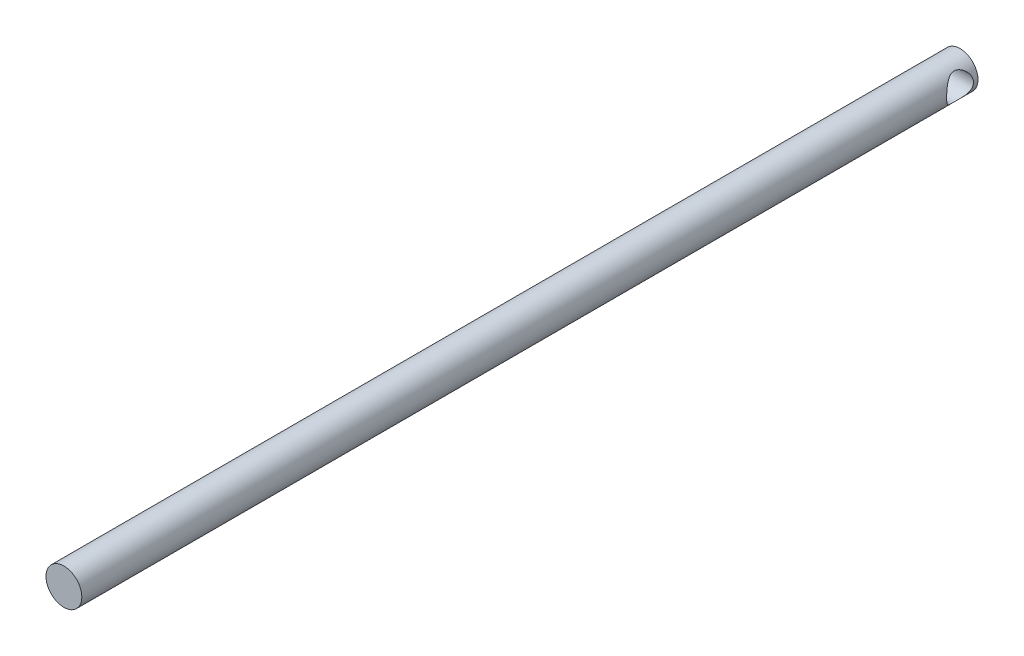
ISO-10303-21;
HEADER;
FILE_DESCRIPTION(('STEP AP214'),'2;1');
FILE_NAME('part.step','',(''),(''),'','','');
FILE_SCHEMA(('AUTOMOTIVE_DESIGN { 1 0 10303 214 1 1 1 1 }'));
ENDSEC;
DATA;
#1=APPLICATION_CONTEXT('core data for automotive mechanical design processes');
#2=APPLICATION_PROTOCOL_DEFINITION('international standard','automotive_design',2000,#1);
#3=PRODUCT_CONTEXT('',#1,'mechanical');
#4=PRODUCT('Part','Part','',(#3));
#5=PRODUCT_RELATED_PRODUCT_CATEGORY('part','',(#4));
#6=PRODUCT_DEFINITION_FORMATION('','',#4);
#7=PRODUCT_DEFINITION_CONTEXT('part definition',#1,'design');
#8=PRODUCT_DEFINITION('design','',#6,#7);
#9=PRODUCT_DEFINITION_SHAPE('','',#8);
#10=(LENGTH_UNIT() NAMED_UNIT(*) SI_UNIT(.MILLI.,.METRE.));
#11=(NAMED_UNIT(*) PLANE_ANGLE_UNIT() SI_UNIT($,.RADIAN.));
#12=(NAMED_UNIT(*) SI_UNIT($,.STERADIAN.) SOLID_ANGLE_UNIT());
#13=UNCERTAINTY_MEASURE_WITH_UNIT(LENGTH_MEASURE(1.E-05),#10,'distance_accuracy_value','');
#14=(GEOMETRIC_REPRESENTATION_CONTEXT(3) GLOBAL_UNCERTAINTY_ASSIGNED_CONTEXT((#13)) GLOBAL_UNIT_ASSIGNED_CONTEXT((#10,
#11,#12)) REPRESENTATION_CONTEXT('',''));
#15=CARTESIAN_POINT('',(0.,0.,0.));
#16=DIRECTION('',(0.,0.,1.));
#17=DIRECTION('',(1.,0.,0.));
#18=AXIS2_PLACEMENT_3D('',#15,#16,#17);
#19=CARTESIAN_POINT('',(0.,0.,500.));
#20=DIRECTION('',(0.,0.,-1.));
#21=DIRECTION('',(-1.,0.,0.));
#22=AXIS2_PLACEMENT_3D('',#19,#20,#21);
#23=CYLINDRICAL_SURFACE('',#22,10.);
#24=CARTESIAN_POINT('',(-10.,0.,2.5));
#25=CARTESIAN_POINT('',(-9.99999825220043,0.183148360631224,2.50000181106261));
#26=CARTESIAN_POINT('',(-9.99495621731441,0.366342585140464,2.50672095644631));
#27=CARTESIAN_POINT('',(-9.97490143097507,0.731284647804646,2.5334924645278));
#28=CARTESIAN_POINT('',(-9.95988271339075,0.913031554599345,2.55355280536876));
#29=CARTESIAN_POINT('',(-9.9201917868147,1.27389276294165,2.60672475330212));
#30=CARTESIAN_POINT('',(-9.89550118322144,1.45300136929127,2.63986123030484));
#31=CARTESIAN_POINT('',(-9.83702172640045,1.8069893726824,2.71867503216433));
#32=CARTESIAN_POINT('',(-9.80322881221236,1.98186684397495,2.76435795474781));
#33=CARTESIAN_POINT('',(-9.72752378128582,2.32506995293138,2.86726367830834));
#34=CARTESIAN_POINT('',(-9.6856665671512,2.49343113760904,2.92440854751618));
#35=CARTESIAN_POINT('',(-9.59451489400363,2.82395570771372,3.04970833708236));
#36=CARTESIAN_POINT('',(-9.5452174929203,2.98611660943024,3.11786761362111));
#37=CARTESIAN_POINT('',(-9.38756843011347,3.46192400316672,3.33764786702261));
#38=CARTESIAN_POINT('',(-9.26935773011459,3.76534217699647,3.50470784255644));
#39=CARTESIAN_POINT('',(-9.00247083181558,4.36738031046613,3.89132929284911));
#40=CARTESIAN_POINT('',(-8.85198712189838,4.66295396944976,4.11431999491101));
#41=CARTESIAN_POINT('',(-8.53832916588274,5.21514803427101,4.59749586451611));
#42=CARTESIAN_POINT('',(-8.37513550772825,5.47170701559805,4.85773845612116));
#43=CARTESIAN_POINT('',(-8.11230548493661,5.84983236323795,5.30133924823523));
#44=CARTESIAN_POINT('',(-8.01322272061777,5.98448699541009,5.4740761780575));
#45=CARTESIAN_POINT('',(-7.81692237304354,6.23870842573754,5.83147192975619));
#46=CARTESIAN_POINT('',(-7.71970535968098,6.35827067422418,6.01613432137959));
#47=CARTESIAN_POINT('',(-7.53024443396407,6.58155279088788,6.39697113731399));
#48=CARTESIAN_POINT('',(-7.43799561146134,6.68528849377295,6.59313377971528));
#49=CARTESIAN_POINT('',(-7.26194992595442,6.87611265864527,6.99684291791223));
#50=CARTESIAN_POINT('',(-7.17814826410121,6.96321059804277,7.20438284559713));
#51=CARTESIAN_POINT('',(-6.99885956719935,7.14400878104046,7.69745354761176));
#52=CARTESIAN_POINT('',(-6.9078729915952,7.23130376139035,7.98712901800543));
#53=CARTESIAN_POINT('',(-6.79582705692467,7.33616747091051,8.43346972395359));
#54=CARTESIAN_POINT('',(-6.7625626495277,7.36676563602348,8.58413268665275));
#55=CARTESIAN_POINT('',(-6.70541097180997,7.41882486802788,8.88875166846226));
#56=CARTESIAN_POINT('',(-6.68151886959137,7.44029064361234,9.04270594744627));
#57=CARTESIAN_POINT('',(-6.64399487351841,7.4738195774795,9.35438467266927));
#58=CARTESIAN_POINT('',(-6.63046224230684,7.48579180837431,9.51213101210689));
#59=CARTESIAN_POINT('',(-6.61471013710175,7.49971481213819,9.82863357712388));
#60=CARTESIAN_POINT('',(-6.61249035269244,7.50166585998078,9.98738977487384));
#61=CARTESIAN_POINT('',(-6.61948621008001,7.49549374588534,10.3045070458082));
#62=CARTESIAN_POINT('',(-6.62870559451458,7.48736728681514,10.4628679726797));
#63=CARTESIAN_POINT('',(-6.65809333447629,7.46124382754021,10.7777067944034));
#64=CARTESIAN_POINT('',(-6.6782618015552,7.44324672677111,10.934184670054));
#65=CARTESIAN_POINT('',(-6.74840995476556,7.37988631197293,11.3657496870096));
#66=CARTESIAN_POINT('',(-6.80936438102533,7.32413018954154,11.6376055670218));
#67=CARTESIAN_POINT('',(-6.95570310792852,7.18527767988214,12.1672707552838));
#68=CARTESIAN_POINT('',(-7.04111087930064,7.10215501424415,12.4250662838031));
#69=CARTESIAN_POINT('',(-7.21099153900677,6.92917382263755,12.8781694832614));
#70=CARTESIAN_POINT('',(-7.29266351327928,6.84346833605325,13.0761594238641));
#71=CARTESIAN_POINT('',(-7.46342165901279,6.65682611972849,13.46158098312));
#72=CARTESIAN_POINT('',(-7.55251162228971,6.55588157861579,13.6490071188232));
#73=CARTESIAN_POINT('',(-7.73517823120313,6.33933222593356,14.0134638359849));
#74=CARTESIAN_POINT('',(-7.82876380678446,6.22369741624747,14.1904720297294));
#75=CARTESIAN_POINT('',(-8.01761553681547,5.97844426893635,14.5335028841527));
#76=CARTESIAN_POINT('',(-8.11288142581883,5.84882812374303,14.6995272606499));
#77=CARTESIAN_POINT('',(-8.30521453319946,5.57247402890015,15.024354951916));
#78=CARTESIAN_POINT('',(-8.40226649936021,5.42538639972571,15.1828700952384));
#79=CARTESIAN_POINT('',(-8.5935031315706,5.11709028531976,15.4874712931344));
#80=CARTESIAN_POINT('',(-8.68768750660852,4.95588037331081,15.6335560889212));
#81=CARTESIAN_POINT('',(-8.87089324795422,4.61993509999966,15.9121685815808));
#82=CARTESIAN_POINT('',(-8.9599230830712,4.44522309293499,16.0447188059507));
#83=CARTESIAN_POINT('',(-9.13090472642982,4.08249343487889,16.2953804981527));
#84=CARTESIAN_POINT('',(-9.21285834099645,3.89447920193417,16.4134956539972));
#85=CARTESIAN_POINT('',(-9.35211813533672,3.54483535127364,16.6118106225478));
#86=CARTESIAN_POINT('',(-9.41107137526017,3.38547499880139,16.6948639787926));
#87=CARTESIAN_POINT('',(-9.52211460031246,3.05924910859919,16.8500808784182));
#88=CARTESIAN_POINT('',(-9.57420599638373,2.89238512327235,16.9222466609628));
#89=CARTESIAN_POINT('',(-9.67052015896568,2.55192522953366,17.0548590763305));
#90=CARTESIAN_POINT('',(-9.71474587063951,2.37833187059297,17.1153100962974));
#91=CARTESIAN_POINT('',(-9.7944303324846,2.02530797337889,17.2237259983825));
#92=CARTESIAN_POINT('',(-9.82988897006302,1.84587736017292,17.2716907201434));
#93=CARTESIAN_POINT('',(-9.89142668215868,1.48124003999791,17.3546653228274));
#94=CARTESIAN_POINT('',(-9.91744578882848,1.29600425567115,17.3895924169133));
#95=CARTESIAN_POINT('',(-9.95915423278582,0.922276966538737,17.4454751063309));
#96=CARTESIAN_POINT('',(-9.97484354492046,0.733785453806582,17.4664306676423));
#97=CARTESIAN_POINT('',(-9.99548555303477,0.355230498112983,17.4939852447411));
#98=CARTESIAN_POINT('',(-10.0004418293711,0.165167600582668,17.5005890480314));
#99=CARTESIAN_POINT('',(-9.99949640206274,-0.214874139571318,17.4993285937768));
#100=CARTESIAN_POINT('',(-9.99359555401241,-0.404852987638413,17.4914654762959));
#101=CARTESIAN_POINT('',(-9.97223305994797,-0.763928127056921,17.4629423697379));
#102=CARTESIAN_POINT('',(-9.95779618888371,-0.933197305435485,17.4436536580073));
#103=CARTESIAN_POINT('',(-9.92057133553495,-1.26918880187071,17.393781950484));
#104=CARTESIAN_POINT('',(-9.89778056893783,-1.43591025146061,17.36319518908));
#105=CARTESIAN_POINT('',(-9.84430767733922,-1.76564432096826,17.2911573494213));
#106=CARTESIAN_POINT('',(-9.81362747999547,-1.92865783628605,17.2497089249952));
#107=CARTESIAN_POINT('',(-9.74493618777163,-2.25016822648629,17.1564499227148));
#108=CARTESIAN_POINT('',(-9.70692222377835,-2.40866330572276,17.1046352891018));
#109=CARTESIAN_POINT('',(-9.62279034107677,-2.72575422161847,16.9892566436357));
#110=CARTESIAN_POINT('',(-9.57643622072002,-2.88416117889076,16.9253461741077));
#111=CARTESIAN_POINT('',(-9.47738924248976,-3.19463271777294,16.7877229490928));
#112=CARTESIAN_POINT('',(-9.42469423001768,-3.34669511976835,16.714006860811));
#113=CARTESIAN_POINT('',(-9.25839398463924,-3.79243668836605,16.4792069241768));
#114=CARTESIAN_POINT('',(-9.13650809547068,-4.0759094224292,16.3043830298445));
#115=CARTESIAN_POINT('',(-8.85592689861201,-4.65763303463208,15.8910388757337));
#116=CARTESIAN_POINT('',(-8.69448369509785,-4.95044606090116,15.6467569844664));
#117=CARTESIAN_POINT('',(-8.44516881462102,-5.35767107336566,15.2517852965719));
#118=CARTESIAN_POINT('',(-8.36074234741944,-5.48824918209259,15.1151472141624));
#119=CARTESIAN_POINT('',(-8.19100904652956,-5.73848345968049,14.8327407122706));
#120=CARTESIAN_POINT('',(-8.10570242630511,-5.85814221058998,14.6869744651008));
#121=CARTESIAN_POINT('',(-7.91961196391863,-6.10806144849819,14.3579836003852));
#122=CARTESIAN_POINT('',(-7.81897317293294,-6.23600392340882,14.1729105765989));
#123=CARTESIAN_POINT('',(-7.62168627596285,-6.47564568677308,13.7903779523481));
#124=CARTESIAN_POINT('',(-7.52503964549599,-6.58733900727102,13.5929138388307));
#125=CARTESIAN_POINT('',(-7.33958950470876,-6.79334858159907,13.1862601442869));
#126=CARTESIAN_POINT('',(-7.2507678217486,-6.88770568215121,12.9770996801148));
#127=CARTESIAN_POINT('',(-7.08503810393456,-7.05807032553021,12.546968719068));
#128=CARTESIAN_POINT('',(-7.00812021113291,-7.13409308112476,12.3260082004461));
#129=CARTESIAN_POINT('',(-6.89776536900087,-7.24045739920368,11.9612634200972));
#130=CARTESIAN_POINT('',(-6.85905105065739,-7.27706722475707,11.820878649422));
#131=CARTESIAN_POINT('',(-6.78909215619301,-7.34237828490353,11.5364734323071));
#132=CARTESIAN_POINT('',(-6.75784495867727,-7.37108229544015,11.3924542814349));
#133=CARTESIAN_POINT('',(-6.70397772845789,-7.42010866141178,11.1016728535583));
#134=CARTESIAN_POINT('',(-6.68134175721603,-7.4404465075322,10.9549161770611));
#135=CARTESIAN_POINT('',(-6.64553659947693,-7.47244433482206,10.6592977877309));
#136=CARTESIAN_POINT('',(-6.63236743689916,-7.48410429406539,10.5104360695801));
#137=CARTESIAN_POINT('',(-6.61604392687071,-7.49853887636308,10.2109543865269));
#138=CARTESIAN_POINT('',(-6.61294157310429,-7.5012673702604,10.060329313336));
#139=CARTESIAN_POINT('',(-6.61704410383112,-7.49764855771467,9.75933492899877));
#140=CARTESIAN_POINT('',(-6.6242487717127,-7.49130144200399,9.60896561254406));
#141=CARTESIAN_POINT('',(-6.64864042221955,-7.46966150960367,9.30955966115998));
#142=CARTESIAN_POINT('',(-6.66583653866429,-7.45436050750457,9.1605243725003));
#143=CARTESIAN_POINT('',(-6.70947271822503,-7.41510828933917,8.86491296274473));
#144=CARTESIAN_POINT('',(-6.73591768435148,-7.39115248495673,8.71833818929699));
#145=CARTESIAN_POINT('',(-6.80366991769713,-7.32888993758964,8.39698143694981));
#146=CARTESIAN_POINT('',(-6.84695911424574,-7.28859466709028,8.22300243854851));
#147=CARTESIAN_POINT('',(-6.94360749633832,-7.19657956576836,7.8808805847487));
#148=CARTESIAN_POINT('',(-6.99697427787176,-7.14485111212704,7.71274224567655));
#149=CARTESIAN_POINT('',(-7.11173285585202,-7.03063417120002,7.38260515556822));
#150=CARTESIAN_POINT('',(-7.17314049085418,-6.96812436806886,7.22061935799918));
#151=CARTESIAN_POINT('',(-7.30189696957417,-6.83308175773697,6.90343735825427));
#152=CARTESIAN_POINT('',(-7.36924400073342,-6.76055200457875,6.74823910616528));
#153=CARTESIAN_POINT('',(-7.53227527340475,-6.57908862155701,6.39191440763987));
#154=CARTESIAN_POINT('',(-7.62967949604614,-6.46625899136202,6.19355104030994));
#155=CARTESIAN_POINT('',(-7.82848797542238,-6.22409397674892,5.80926560822968));
#156=CARTESIAN_POINT('',(-7.92989347166993,-6.09475344941421,5.62334744761327));
#157=CARTESIAN_POINT('',(-8.13368678615596,-5.82000166017292,5.26410018248664));
#158=CARTESIAN_POINT('',(-8.23607528693576,-5.67457836362909,5.09078066839321));
#159=CARTESIAN_POINT('',(-8.43902615179917,-5.36811116429771,4.75742106763493));
#160=CARTESIAN_POINT('',(-8.53958873605844,-5.20706915992245,4.5973793714633));
#161=CARTESIAN_POINT('',(-8.73722404742755,-4.86823444610667,4.29009342782366));
#162=CARTESIAN_POINT('',(-8.83426032912377,-4.69031229919782,4.1429680758643));
#163=CARTESIAN_POINT('',(-9.02148209885813,-4.31926384766125,3.86422000820311));
#164=CARTESIAN_POINT('',(-9.11166669061666,-4.12613556060168,3.73259931945357));
#165=CARTESIAN_POINT('',(-9.28256253574139,-3.72576429558786,3.48664683473564));
#166=CARTESIAN_POINT('',(-9.36329167565035,-3.51854917893225,3.37228227378446));
#167=CARTESIAN_POINT('',(-9.51304471510835,-3.09083237545736,3.16235194822691));
#168=CARTESIAN_POINT('',(-9.5820746530538,-2.87033762289901,3.06677648176524));
#169=CARTESIAN_POINT('',(-9.68796526126722,-2.48412405824608,2.9212735772535));
#170=CARTESIAN_POINT('',(-9.72832482945904,-2.32129005811085,2.86617700851184));
#171=CARTESIAN_POINT('',(-9.80132549603498,-1.9906420118458,2.76694296017012));
#172=CARTESIAN_POINT('',(-9.83396846856479,-1.82282918610053,2.72280281942897));
#173=CARTESIAN_POINT('',(-9.89082818213226,-1.48358839494539,2.64614790452321));
#174=CARTESIAN_POINT('',(-9.91506439962452,-1.31216977477246,2.61360625452351));
#175=CARTESIAN_POINT('',(-9.95469855719796,-0.966540401338081,2.56048804100351));
#176=CARTESIAN_POINT('',(-9.9701010169854,-0.792331122875267,2.53990535872308));
#177=CARTESIAN_POINT('',(-9.98726751877774,-0.514835906933092,2.51698319841702));
#178=CARTESIAN_POINT('',(-9.99203792739739,-0.412044960462382,2.51061884813289));
#179=CARTESIAN_POINT('',(-9.9984049153868,-0.206174215981064,2.50212639822716));
#180=CARTESIAN_POINT('',(-10.0000009838379,-0.103094374145229,2.49999898055125));
#181=CARTESIAN_POINT('',(-10.,0.,2.5));
#182=B_SPLINE_CURVE_WITH_KNOTS('',3,(#24,#25,#26,#27,#28,#29,#30,#31,#32,#33,#34,#35,#36,#37,
#38,#39,#40,#41,#42,#43,#44,#45,#46,#47,#48,#49,#50,#51,#52,#53,#54,#55,#56,#57,#58,#59,#60,#61,
#62,#63,#64,#65,#66,#67,#68,#69,#70,#71,#72,#73,#74,#75,#76,#77,#78,#79,#80,#81,#82,#83,#84,#85,
#86,#87,#88,#89,#90,#91,#92,#93,#94,#95,#96,#97,#98,#99,#100,#101,#102,#103,#104,#105,#106,#107,
#108,#109,#110,#111,#112,#113,#114,#115,#116,#117,#118,#119,#120,#121,#122,#123,#124,#125,#126,
#127,#128,#129,#130,#131,#132,#133,#134,#135,#136,#137,#138,#139,#140,#141,#142,#143,#144,#145,
#146,#147,#148,#149,#150,#151,#152,#153,#154,#155,#156,#157,#158,#159,#160,#161,#162,#163,#164,
#165,#166,#167,#168,#169,#170,#171,#172,#173,#174,#175,#176,#177,#178,#179,#180,#181),
.UNSPECIFIED.,.T.,.F.,(4,2,2,2,2,2,2,2,2,2,2,2,2,2,2,2,2,2,2,2,2,2,2,2,2,2,2,2,2,2,2,2,2,2,2,2,
2,2,2,2,2,2,2,2,2,2,2,2,2,2,2,2,2,2,2,2,2,2,2,2,2,2,2,2,2,2,2,2,2,2,2,2,2,2,2,2,2,2,4),(0.,
0.549333810396349,1.09899642261334,1.64970953325451,2.20066875053375,2.74800168216963,
3.29555161528971,4.38923194166926,5.58419151329428,6.78101336768092,7.50152042078937,
8.22224415798694,8.94224200290019,9.6618284825884,10.6057257062582,11.0771415311411,
11.5483139968762,12.0239465220089,12.4995659960823,12.9753411231469,13.4511210976087,
14.3000658907337,15.1498282626302,15.8409837223713,16.5324946713612,17.2254411215001,
17.9182790673241,18.6286106705283,19.3390141216436,20.0482151836289,20.7572346715093,
21.3240789510858,21.8908064927599,22.4573213847599,23.0238435519584,23.5939042031105,
24.163966242347,24.733838089351,25.3036650295946,25.8159956353881,26.3284971539712,
26.8408735696905,27.3534508450853,27.8838865184232,28.4145029424248,29.4749536671179,
30.7125000722884,31.3331067040452,31.9535662015578,32.6921380168984,33.4309804122227,
34.168059012369,34.9045239072425,35.3546199278826,35.804557705681,36.2536585931601,
36.7027606153631,37.1541785263257,37.6055869504596,38.0574086864992,38.5094703067444,
39.0599080061886,39.610762266734,40.1627183763172,40.7145066214401,41.457880510944,
42.2014865187519,42.9456527762346,43.6897286953816,44.440059867972,45.1904890240893,
45.9394748739468,46.6880729590086,47.2172824489513,47.7463632763237,48.2742100312628,
48.801786477061,49.1109572068324,49.4201776944439),.UNSPECIFIED.);
#183=CARTESIAN_POINT('',(-10.,0.,2.5));
#184=VERTEX_POINT('',#183);
#185=EDGE_CURVE('E10',#184,#184,#182,.T.);
#186=ORIENTED_EDGE('',*,*,#185,.T.);
#187=EDGE_LOOP('',(#186));
#188=FACE_BOUND('',#187,.T.);
#189=CARTESIAN_POINT('',(10.,0.,2.5));
#190=CARTESIAN_POINT('',(9.99999825220043,-0.183148360631224,2.50000181106261));
#191=CARTESIAN_POINT('',(9.99495621731441,-0.366342585140464,2.50672095644631));
#192=CARTESIAN_POINT('',(9.97490143097507,-0.731284647804646,2.5334924645278));
#193=CARTESIAN_POINT('',(9.95988271339075,-0.913031554599345,2.55355280536876));
#194=CARTESIAN_POINT('',(9.9201917868147,-1.27389276294165,2.60672475330212));
#195=CARTESIAN_POINT('',(9.89550118322144,-1.45300136929127,2.63986123030484));
#196=CARTESIAN_POINT('',(9.83702172640045,-1.8069893726824,2.71867503216433));
#197=CARTESIAN_POINT('',(9.80322881221236,-1.98186684397495,2.76435795474781));
#198=CARTESIAN_POINT('',(9.72752378128582,-2.32506995293138,2.86726367830834));
#199=CARTESIAN_POINT('',(9.6856665671512,-2.49343113760904,2.92440854751618));
#200=CARTESIAN_POINT('',(9.59451489400363,-2.82395570771372,3.04970833708236));
#201=CARTESIAN_POINT('',(9.5452174929203,-2.98611660943024,3.11786761362111));
#202=CARTESIAN_POINT('',(9.38756843011347,-3.46192400316672,3.33764786702261));
#203=CARTESIAN_POINT('',(9.26935773011459,-3.76534217699647,3.50470784255644));
#204=CARTESIAN_POINT('',(9.00247083181558,-4.36738031046613,3.89132929284911));
#205=CARTESIAN_POINT('',(8.85198712189838,-4.66295396944976,4.11431999491101));
#206=CARTESIAN_POINT('',(8.53832916588274,-5.21514803427101,4.59749586451611));
#207=CARTESIAN_POINT('',(8.37513550772825,-5.47170701559805,4.85773845612116));
#208=CARTESIAN_POINT('',(8.11230548493661,-5.84983236323795,5.30133924823523));
#209=CARTESIAN_POINT('',(8.01322272061777,-5.98448699541009,5.4740761780575));
#210=CARTESIAN_POINT('',(7.81692237304354,-6.23870842573754,5.83147192975619));
#211=CARTESIAN_POINT('',(7.71970535968098,-6.35827067422418,6.01613432137959));
#212=CARTESIAN_POINT('',(7.53024443396407,-6.58155279088788,6.39697113731399));
#213=CARTESIAN_POINT('',(7.43799561146134,-6.68528849377295,6.59313377971528));
#214=CARTESIAN_POINT('',(7.26194992595442,-6.87611265864527,6.99684291791223));
#215=CARTESIAN_POINT('',(7.17814826410121,-6.96321059804277,7.20438284559713));
#216=CARTESIAN_POINT('',(6.99885956719935,-7.14400878104046,7.69745354761176));
#217=CARTESIAN_POINT('',(6.9078729915952,-7.23130376139035,7.98712901800543));
#218=CARTESIAN_POINT('',(6.79582705692467,-7.33616747091051,8.43346972395359));
#219=CARTESIAN_POINT('',(6.7625626495277,-7.36676563602348,8.58413268665275));
#220=CARTESIAN_POINT('',(6.70541097180997,-7.41882486802788,8.88875166846226));
#221=CARTESIAN_POINT('',(6.68151886959137,-7.44029064361234,9.04270594744627));
#222=CARTESIAN_POINT('',(6.64399487351841,-7.4738195774795,9.35438467266927));
#223=CARTESIAN_POINT('',(6.63046224230684,-7.48579180837431,9.51213101210689));
#224=CARTESIAN_POINT('',(6.61471013710175,-7.49971481213819,9.82863357712388));
#225=CARTESIAN_POINT('',(6.61249035269244,-7.50166585998078,9.98738977487384));
#226=CARTESIAN_POINT('',(6.61948621008001,-7.49549374588534,10.3045070458082));
#227=CARTESIAN_POINT('',(6.62870559451458,-7.48736728681514,10.4628679726797));
#228=CARTESIAN_POINT('',(6.65809333447629,-7.46124382754021,10.7777067944034));
#229=CARTESIAN_POINT('',(6.6782618015552,-7.44324672677111,10.934184670054));
#230=CARTESIAN_POINT('',(6.74840995476556,-7.37988631197293,11.3657496870096));
#231=CARTESIAN_POINT('',(6.80936438102533,-7.32413018954154,11.6376055670218));
#232=CARTESIAN_POINT('',(6.95570310792852,-7.18527767988214,12.1672707552838));
#233=CARTESIAN_POINT('',(7.04111087930064,-7.10215501424415,12.4250662838031));
#234=CARTESIAN_POINT('',(7.21099153900677,-6.92917382263755,12.8781694832614));
#235=CARTESIAN_POINT('',(7.29266351327928,-6.84346833605325,13.0761594238641));
#236=CARTESIAN_POINT('',(7.46342165901279,-6.65682611972849,13.46158098312));
#237=CARTESIAN_POINT('',(7.55251162228971,-6.55588157861579,13.6490071188232));
#238=CARTESIAN_POINT('',(7.73517823120313,-6.33933222593356,14.0134638359849));
#239=CARTESIAN_POINT('',(7.82876380678446,-6.22369741624747,14.1904720297294));
#240=CARTESIAN_POINT('',(8.01761553681547,-5.97844426893635,14.5335028841527));
#241=CARTESIAN_POINT('',(8.11288142581883,-5.84882812374303,14.6995272606499));
#242=CARTESIAN_POINT('',(8.30521453319946,-5.57247402890015,15.024354951916));
#243=CARTESIAN_POINT('',(8.40226649936021,-5.42538639972571,15.1828700952384));
#244=CARTESIAN_POINT('',(8.5935031315706,-5.11709028531976,15.4874712931344));
#245=CARTESIAN_POINT('',(8.68768750660852,-4.95588037331081,15.6335560889212));
#246=CARTESIAN_POINT('',(8.87089324795422,-4.61993509999966,15.9121685815808));
#247=CARTESIAN_POINT('',(8.9599230830712,-4.44522309293499,16.0447188059507));
#248=CARTESIAN_POINT('',(9.13090472642982,-4.08249343487889,16.2953804981527));
#249=CARTESIAN_POINT('',(9.21285834099645,-3.89447920193417,16.4134956539972));
#250=CARTESIAN_POINT('',(9.35211813533672,-3.54483535127364,16.6118106225478));
#251=CARTESIAN_POINT('',(9.41107137526017,-3.38547499880139,16.6948639787926));
#252=CARTESIAN_POINT('',(9.52211460031246,-3.05924910859919,16.8500808784182));
#253=CARTESIAN_POINT('',(9.57420599638373,-2.89238512327235,16.9222466609628));
#254=CARTESIAN_POINT('',(9.67052015896568,-2.55192522953366,17.0548590763305));
#255=CARTESIAN_POINT('',(9.71474587063951,-2.37833187059297,17.1153100962974));
#256=CARTESIAN_POINT('',(9.7944303324846,-2.02530797337889,17.2237259983825));
#257=CARTESIAN_POINT('',(9.82988897006302,-1.84587736017292,17.2716907201434));
#258=CARTESIAN_POINT('',(9.89142668215868,-1.48124003999791,17.3546653228274));
#259=CARTESIAN_POINT('',(9.91744578882848,-1.29600425567115,17.3895924169133));
#260=CARTESIAN_POINT('',(9.95915423278582,-0.922276966538737,17.4454751063309));
#261=CARTESIAN_POINT('',(9.97484354492046,-0.733785453806582,17.4664306676423));
#262=CARTESIAN_POINT('',(9.99548555303477,-0.355230498112983,17.4939852447411));
#263=CARTESIAN_POINT('',(10.0004418293711,-0.165167600582668,17.5005890480314));
#264=CARTESIAN_POINT('',(9.99949640206274,0.214874139571318,17.4993285937768));
#265=CARTESIAN_POINT('',(9.99359555401241,0.404852987638413,17.4914654762959));
#266=CARTESIAN_POINT('',(9.97223305994797,0.763928127056921,17.4629423697379));
#267=CARTESIAN_POINT('',(9.95779618888371,0.933197305435485,17.4436536580073));
#268=CARTESIAN_POINT('',(9.92057133553495,1.26918880187071,17.393781950484));
#269=CARTESIAN_POINT('',(9.89778056893783,1.43591025146061,17.36319518908));
#270=CARTESIAN_POINT('',(9.84430767733922,1.76564432096826,17.2911573494213));
#271=CARTESIAN_POINT('',(9.81362747999547,1.92865783628605,17.2497089249952));
#272=CARTESIAN_POINT('',(9.74493618777163,2.25016822648629,17.1564499227148));
#273=CARTESIAN_POINT('',(9.70692222377835,2.40866330572276,17.1046352891018));
#274=CARTESIAN_POINT('',(9.62279034107677,2.72575422161847,16.9892566436357));
#275=CARTESIAN_POINT('',(9.57643622072002,2.88416117889076,16.9253461741077));
#276=CARTESIAN_POINT('',(9.47738924248976,3.19463271777294,16.7877229490928));
#277=CARTESIAN_POINT('',(9.42469423001768,3.34669511976835,16.714006860811));
#278=CARTESIAN_POINT('',(9.25839398463924,3.79243668836605,16.4792069241768));
#279=CARTESIAN_POINT('',(9.13650809547068,4.0759094224292,16.3043830298445));
#280=CARTESIAN_POINT('',(8.85592689861201,4.65763303463208,15.8910388757337));
#281=CARTESIAN_POINT('',(8.69448369509785,4.95044606090116,15.6467569844664));
#282=CARTESIAN_POINT('',(8.44516881462102,5.35767107336566,15.2517852965719));
#283=CARTESIAN_POINT('',(8.36074234741944,5.48824918209259,15.1151472141624));
#284=CARTESIAN_POINT('',(8.19100904652956,5.73848345968049,14.8327407122706));
#285=CARTESIAN_POINT('',(8.10570242630511,5.85814221058998,14.6869744651008));
#286=CARTESIAN_POINT('',(7.91961196391863,6.10806144849819,14.3579836003852));
#287=CARTESIAN_POINT('',(7.81897317293294,6.23600392340882,14.1729105765989));
#288=CARTESIAN_POINT('',(7.62168627596285,6.47564568677308,13.7903779523481));
#289=CARTESIAN_POINT('',(7.52503964549599,6.58733900727102,13.5929138388307));
#290=CARTESIAN_POINT('',(7.33958950470876,6.79334858159907,13.1862601442869));
#291=CARTESIAN_POINT('',(7.2507678217486,6.88770568215121,12.9770996801148));
#292=CARTESIAN_POINT('',(7.08503810393456,7.05807032553021,12.546968719068));
#293=CARTESIAN_POINT('',(7.00812021113291,7.13409308112476,12.3260082004461));
#294=CARTESIAN_POINT('',(6.89776536900087,7.24045739920368,11.9612634200972));
#295=CARTESIAN_POINT('',(6.85905105065739,7.27706722475707,11.820878649422));
#296=CARTESIAN_POINT('',(6.78909215619301,7.34237828490353,11.5364734323071));
#297=CARTESIAN_POINT('',(6.75784495867727,7.37108229544015,11.3924542814349));
#298=CARTESIAN_POINT('',(6.70397772845789,7.42010866141178,11.1016728535583));
#299=CARTESIAN_POINT('',(6.68134175721603,7.4404465075322,10.9549161770611));
#300=CARTESIAN_POINT('',(6.64553659947693,7.47244433482206,10.6592977877309));
#301=CARTESIAN_POINT('',(6.63236743689916,7.48410429406539,10.5104360695801));
#302=CARTESIAN_POINT('',(6.61604392687071,7.49853887636308,10.2109543865269));
#303=CARTESIAN_POINT('',(6.61294157310429,7.5012673702604,10.060329313336));
#304=CARTESIAN_POINT('',(6.61704410383112,7.49764855771467,9.75933492899877));
#305=CARTESIAN_POINT('',(6.6242487717127,7.49130144200399,9.60896561254406));
#306=CARTESIAN_POINT('',(6.64864042221955,7.46966150960367,9.30955966115998));
#307=CARTESIAN_POINT('',(6.66583653866429,7.45436050750457,9.1605243725003));
#308=CARTESIAN_POINT('',(6.70947271822503,7.41510828933917,8.86491296274473));
#309=CARTESIAN_POINT('',(6.73591768435148,7.39115248495673,8.71833818929699));
#310=CARTESIAN_POINT('',(6.80366991769713,7.32888993758964,8.39698143694981));
#311=CARTESIAN_POINT('',(6.84695911424574,7.28859466709028,8.22300243854851));
#312=CARTESIAN_POINT('',(6.94360749633832,7.19657956576836,7.8808805847487));
#313=CARTESIAN_POINT('',(6.99697427787176,7.14485111212704,7.71274224567655));
#314=CARTESIAN_POINT('',(7.11173285585202,7.03063417120002,7.38260515556822));
#315=CARTESIAN_POINT('',(7.17314049085418,6.96812436806886,7.22061935799918));
#316=CARTESIAN_POINT('',(7.30189696957417,6.83308175773697,6.90343735825427));
#317=CARTESIAN_POINT('',(7.36924400073342,6.76055200457875,6.74823910616528));
#318=CARTESIAN_POINT('',(7.53227527340475,6.57908862155701,6.39191440763987));
#319=CARTESIAN_POINT('',(7.62967949604614,6.46625899136202,6.19355104030994));
#320=CARTESIAN_POINT('',(7.82848797542238,6.22409397674892,5.80926560822968));
#321=CARTESIAN_POINT('',(7.92989347166993,6.09475344941421,5.62334744761327));
#322=CARTESIAN_POINT('',(8.13368678615596,5.82000166017292,5.26410018248664));
#323=CARTESIAN_POINT('',(8.23607528693576,5.67457836362909,5.09078066839321));
#324=CARTESIAN_POINT('',(8.43902615179917,5.36811116429771,4.75742106763493));
#325=CARTESIAN_POINT('',(8.53958873605844,5.20706915992245,4.5973793714633));
#326=CARTESIAN_POINT('',(8.73722404742755,4.86823444610667,4.29009342782366));
#327=CARTESIAN_POINT('',(8.83426032912377,4.69031229919782,4.1429680758643));
#328=CARTESIAN_POINT('',(9.02148209885813,4.31926384766125,3.86422000820311));
#329=CARTESIAN_POINT('',(9.11166669061666,4.12613556060168,3.73259931945357));
#330=CARTESIAN_POINT('',(9.28256253574139,3.72576429558786,3.48664683473564));
#331=CARTESIAN_POINT('',(9.36329167565035,3.51854917893225,3.37228227378446));
#332=CARTESIAN_POINT('',(9.51304471510835,3.09083237545736,3.16235194822691));
#333=CARTESIAN_POINT('',(9.5820746530538,2.87033762289901,3.06677648176524));
#334=CARTESIAN_POINT('',(9.68796526126722,2.48412405824608,2.9212735772535));
#335=CARTESIAN_POINT('',(9.72832482945904,2.32129005811085,2.86617700851184));
#336=CARTESIAN_POINT('',(9.80132549603498,1.9906420118458,2.76694296017012));
#337=CARTESIAN_POINT('',(9.83396846856479,1.82282918610053,2.72280281942897));
#338=CARTESIAN_POINT('',(9.89082818213226,1.48358839494539,2.64614790452321));
#339=CARTESIAN_POINT('',(9.91506439962452,1.31216977477246,2.61360625452351));
#340=CARTESIAN_POINT('',(9.95469855719796,0.966540401338081,2.56048804100351));
#341=CARTESIAN_POINT('',(9.9701010169854,0.792331122875267,2.53990535872308));
#342=CARTESIAN_POINT('',(9.98726751877774,0.514835906933092,2.51698319841702));
#343=CARTESIAN_POINT('',(9.99203792739739,0.412044960462382,2.51061884813289));
#344=CARTESIAN_POINT('',(9.9984049153868,0.206174215981064,2.50212639822716));
#345=CARTESIAN_POINT('',(10.0000009838379,0.103094374145229,2.49999898055125));
#346=CARTESIAN_POINT('',(10.,0.,2.5));
#347=B_SPLINE_CURVE_WITH_KNOTS('',3,(#189,#190,#191,#192,#193,#194,#195,#196,#197,#198,#199,
#200,#201,#202,#203,#204,#205,#206,#207,#208,#209,#210,#211,#212,#213,#214,#215,#216,#217,#218,
#219,#220,#221,#222,#223,#224,#225,#226,#227,#228,#229,#230,#231,#232,#233,#234,#235,#236,#237,
#238,#239,#240,#241,#242,#243,#244,#245,#246,#247,#248,#249,#250,#251,#252,#253,#254,#255,#256,
#257,#258,#259,#260,#261,#262,#263,#264,#265,#266,#267,#268,#269,#270,#271,#272,#273,#274,#275,
#276,#277,#278,#279,#280,#281,#282,#283,#284,#285,#286,#287,#288,#289,#290,#291,#292,#293,#294,
#295,#296,#297,#298,#299,#300,#301,#302,#303,#304,#305,#306,#307,#308,#309,#310,#311,#312,#313,
#314,#315,#316,#317,#318,#319,#320,#321,#322,#323,#324,#325,#326,#327,#328,#329,#330,#331,#332,
#333,#334,#335,#336,#337,#338,#339,#340,#341,#342,#343,#344,#345,#346),.UNSPECIFIED.,.T.,.F.,(4,
2,2,2,2,2,2,2,2,2,2,2,2,2,2,2,2,2,2,2,2,2,2,2,2,2,2,2,2,2,2,2,2,2,2,2,2,2,2,2,2,2,2,2,2,2,2,2,2,
2,2,2,2,2,2,2,2,2,2,2,2,2,2,2,2,2,2,2,2,2,2,2,2,2,2,2,2,2,4),(0.,0.549333810396349,
1.09899642261334,1.64970953325451,2.20066875053375,2.74800168216963,3.29555161528971,
4.38923194166926,5.58419151329428,6.78101336768092,7.50152042078937,8.22224415798694,
8.94224200290019,9.6618284825884,10.6057257062582,11.0771415311411,11.5483139968762,
12.0239465220089,12.4995659960823,12.9753411231469,13.4511210976087,14.3000658907337,
15.1498282626302,15.8409837223713,16.5324946713612,17.2254411215001,17.9182790673241,
18.6286106705283,19.3390141216436,20.0482151836289,20.7572346715093,21.3240789510858,
21.8908064927599,22.4573213847599,23.0238435519584,23.5939042031105,24.163966242347,
24.733838089351,25.3036650295946,25.8159956353881,26.3284971539712,26.8408735696905,
27.3534508450853,27.8838865184232,28.4145029424248,29.4749536671179,30.7125000722884,
31.3331067040452,31.9535662015578,32.6921380168984,33.4309804122227,34.168059012369,
34.9045239072425,35.3546199278826,35.804557705681,36.2536585931601,36.7027606153631,
37.1541785263257,37.6055869504596,38.0574086864992,38.5094703067444,39.0599080061886,
39.610762266734,40.1627183763172,40.7145066214401,41.457880510944,42.2014865187519,
42.9456527762346,43.6897286953816,44.440059867972,45.1904890240893,45.9394748739468,
46.6880729590086,47.2172824489513,47.7463632763237,48.2742100312628,48.801786477061,
49.1109572068324,49.4201776944439),.UNSPECIFIED.);
#348=CARTESIAN_POINT('',(10.,0.,2.5));
#349=VERTEX_POINT('',#348);
#350=EDGE_CURVE('E49',#349,#349,#347,.T.);
#351=ORIENTED_EDGE('',*,*,#350,.T.);
#352=EDGE_LOOP('',(#351));
#353=FACE_BOUND('',#352,.T.);
#354=CARTESIAN_POINT('',(0.,0.,500.));
#355=DIRECTION('',(0.,0.,1.));
#356=DIRECTION('',(1.,0.,0.));
#357=AXIS2_PLACEMENT_3D('',#354,#355,#356);
#358=CIRCLE('',#357,10.);
#359=CARTESIAN_POINT('',(10.,0.,500.));
#360=VERTEX_POINT('',#359);
#361=EDGE_CURVE('E54',#360,#360,#358,.T.);
#362=ORIENTED_EDGE('',*,*,#361,.F.);
#363=EDGE_LOOP('',(#362));
#364=FACE_BOUND('',#363,.T.);
#365=CARTESIAN_POINT('',(0.,0.,0.));
#366=DIRECTION('',(0.,0.,1.));
#367=DIRECTION('',(1.,0.,0.));
#368=AXIS2_PLACEMENT_3D('',#365,#366,#367);
#369=CIRCLE('',#368,10.);
#370=CARTESIAN_POINT('',(10.,0.,0.));
#371=VERTEX_POINT('',#370);
#372=EDGE_CURVE('E59',#371,#371,#369,.T.);
#373=ORIENTED_EDGE('',*,*,#372,.T.);
#374=EDGE_LOOP('',(#373));
#375=FACE_BOUND('',#374,.T.);
#376=ADVANCED_FACE('F37',(#188,#353,#364,#375),#23,.T.);
#377=CARTESIAN_POINT('',(0.,0.,500.));
#378=DIRECTION('',(0.,0.,1.));
#379=DIRECTION('',(1.,0.,0.));
#380=AXIS2_PLACEMENT_3D('',#377,#378,#379);
#381=PLANE('',#380);
#382=ORIENTED_EDGE('',*,*,#361,.T.);
#383=EDGE_LOOP('',(#382));
#384=FACE_BOUND('',#383,.T.);
#385=ADVANCED_FACE('F71',(#384),#381,.T.);
#386=CARTESIAN_POINT('',(0.,0.,0.));
#387=DIRECTION('',(0.,0.,1.));
#388=DIRECTION('',(1.,0.,0.));
#389=AXIS2_PLACEMENT_3D('',#386,#387,#388);
#390=PLANE('',#389);
#391=ORIENTED_EDGE('',*,*,#372,.F.);
#392=EDGE_LOOP('',(#391));
#393=FACE_BOUND('',#392,.T.);
#394=ADVANCED_FACE('F69',(#393),#390,.F.);
#395=CARTESIAN_POINT('',(-10.,0.,10.));
#396=DIRECTION('',(1.,0.,0.));
#397=DIRECTION('',(0.,0.,-1.));
#398=AXIS2_PLACEMENT_3D('',#395,#396,#397);
#399=CYLINDRICAL_SURFACE('',#398,7.5);
#400=ORIENTED_EDGE('',*,*,#350,.F.);
#401=EDGE_LOOP('',(#400));
#402=FACE_BOUND('',#401,.T.);
#403=ORIENTED_EDGE('',*,*,#185,.F.);
#404=EDGE_LOOP('',(#403));
#405=FACE_BOUND('',#404,.T.);
#406=ADVANCED_FACE('F65',(#402,#405),#399,.F.);
#407=CLOSED_SHELL('',(#376,#385,#394,#406));
#408=MANIFOLD_SOLID_BREP('B2',#407);
#409=ADVANCED_BREP_SHAPE_REPRESENTATION('',(#18,#408),#14);
#410=SHAPE_DEFINITION_REPRESENTATION(#9,#409);
ENDSEC;
END-ISO-10303-21;
